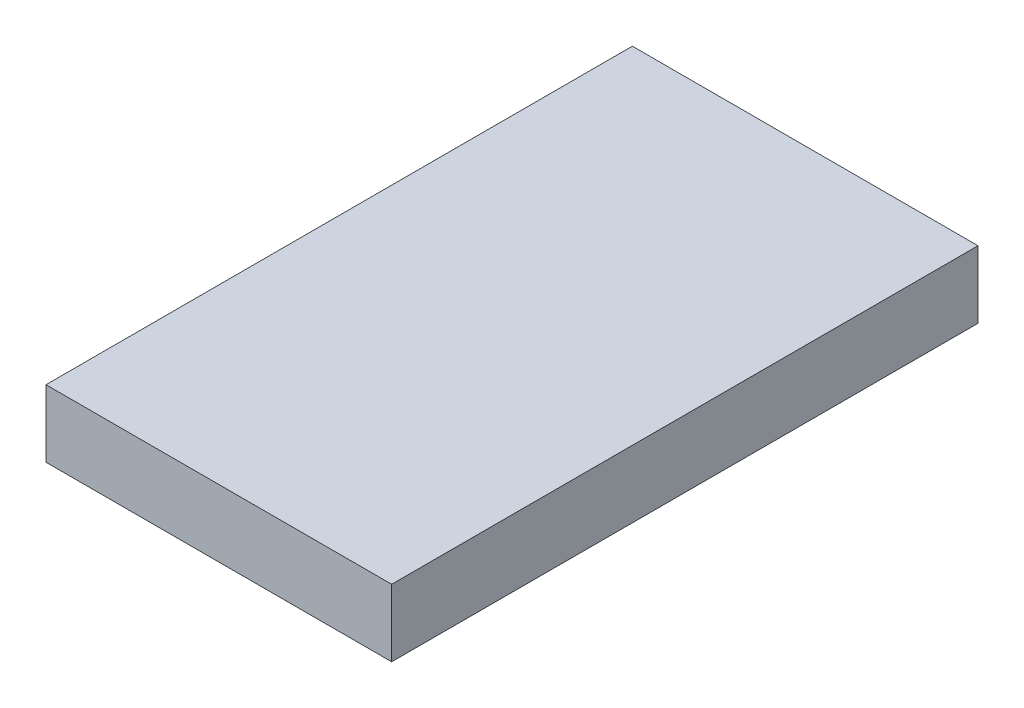
ISO-10303-21;
HEADER;
FILE_DESCRIPTION(('STEP AP214'),'2;1');
FILE_NAME('part.step','',(''),(''),'','','');
FILE_SCHEMA(('AUTOMOTIVE_DESIGN { 1 0 10303 214 1 1 1 1 }'));
ENDSEC;
DATA;
#1=APPLICATION_CONTEXT('core data for automotive mechanical design processes');
#2=APPLICATION_PROTOCOL_DEFINITION('international standard','automotive_design',2000,#1);
#3=PRODUCT_CONTEXT('',#1,'mechanical');
#4=PRODUCT('Part','Part','',(#3));
#5=PRODUCT_RELATED_PRODUCT_CATEGORY('part','',(#4));
#6=PRODUCT_DEFINITION_FORMATION('','',#4);
#7=PRODUCT_DEFINITION_CONTEXT('part definition',#1,'design');
#8=PRODUCT_DEFINITION('design','',#6,#7);
#9=PRODUCT_DEFINITION_SHAPE('','',#8);
#10=(LENGTH_UNIT() NAMED_UNIT(*) SI_UNIT(.MILLI.,.METRE.));
#11=(NAMED_UNIT(*) PLANE_ANGLE_UNIT() SI_UNIT($,.RADIAN.));
#12=(NAMED_UNIT(*) SI_UNIT($,.STERADIAN.) SOLID_ANGLE_UNIT());
#13=UNCERTAINTY_MEASURE_WITH_UNIT(LENGTH_MEASURE(1.E-05),#10,'distance_accuracy_value','');
#14=(GEOMETRIC_REPRESENTATION_CONTEXT(3) GLOBAL_UNCERTAINTY_ASSIGNED_CONTEXT((#13)) GLOBAL_UNIT_ASSIGNED_CONTEXT((#10,
#11,#12)) REPRESENTATION_CONTEXT('',''));
#15=CARTESIAN_POINT('',(0.,0.,0.));
#16=DIRECTION('',(0.,0.,1.));
#17=DIRECTION('',(1.,0.,0.));
#18=AXIS2_PLACEMENT_3D('',#15,#16,#17);
#19=CARTESIAN_POINT('',(0.,4.8,0.));
#20=DIRECTION('',(0.,0.,-1.));
#21=DIRECTION('',(-1.,0.,0.));
#22=AXIS2_PLACEMENT_3D('',#19,#20,#21);
#23=PLANE('',#22);
#24=DIRECTION('',(1.,0.,0.));
#25=VECTOR('',#24,1.);
#26=CARTESIAN_POINT('',(0.,0.,0.));
#27=LINE('',#26,#25);
#28=CARTESIAN_POINT('',(0.,0.,0.));
#29=VERTEX_POINT('',#28);
#30=CARTESIAN_POINT('',(24.7,0.,0.));
#31=VERTEX_POINT('',#30);
#32=EDGE_CURVE('E109',#29,#31,#27,.T.);
#33=ORIENTED_EDGE('',*,*,#32,.T.);
#34=DIRECTION('',(0.,-1.,0.));
#35=VECTOR('',#34,1.);
#36=CARTESIAN_POINT('',(24.7,4.8,0.));
#37=LINE('',#36,#35);
#38=CARTESIAN_POINT('',(24.7,4.8,0.));
#39=VERTEX_POINT('',#38);
#40=EDGE_CURVE('E11',#39,#31,#37,.T.);
#41=ORIENTED_EDGE('',*,*,#40,.F.);
#42=DIRECTION('',(1.,0.,0.));
#43=VECTOR('',#42,1.);
#44=CARTESIAN_POINT('',(0.,4.8,0.));
#45=LINE('',#44,#43);
#46=CARTESIAN_POINT('',(0.,4.8,0.));
#47=VERTEX_POINT('',#46);
#48=EDGE_CURVE('E91',#47,#39,#45,.T.);
#49=ORIENTED_EDGE('',*,*,#48,.F.);
#50=DIRECTION('',(0.,-1.,0.));
#51=VECTOR('',#50,1.);
#52=CARTESIAN_POINT('',(0.,4.8,0.));
#53=LINE('',#52,#51);
#54=EDGE_CURVE('E58',#47,#29,#53,.T.);
#55=ORIENTED_EDGE('',*,*,#54,.T.);
#56=EDGE_LOOP('',(#33,#41,#49,#55));
#57=FACE_BOUND('',#56,.T.);
#58=ADVANCED_FACE('F41',(#57),#23,.F.);
#59=CARTESIAN_POINT('',(24.7,4.8,0.));
#60=DIRECTION('',(-1.,0.,0.));
#61=DIRECTION('',(0.,0.,1.));
#62=AXIS2_PLACEMENT_3D('',#59,#60,#61);
#63=PLANE('',#62);
#64=DIRECTION('',(0.,0.,-1.));
#65=VECTOR('',#64,1.);
#66=CARTESIAN_POINT('',(24.7,0.,0.));
#67=LINE('',#66,#65);
#68=CARTESIAN_POINT('',(24.7,0.,-41.9));
#69=VERTEX_POINT('',#68);
#70=EDGE_CURVE('E97',#31,#69,#67,.T.);
#71=ORIENTED_EDGE('',*,*,#70,.T.);
#72=DIRECTION('',(0.,-1.,0.));
#73=VECTOR('',#72,1.);
#74=CARTESIAN_POINT('',(24.7,4.8,-41.9));
#75=LINE('',#74,#73);
#76=CARTESIAN_POINT('',(24.7,4.8,-41.9));
#77=VERTEX_POINT('',#76);
#78=EDGE_CURVE('E50',#77,#69,#75,.T.);
#79=ORIENTED_EDGE('',*,*,#78,.F.);
#80=DIRECTION('',(0.,0.,-1.));
#81=VECTOR('',#80,1.);
#82=CARTESIAN_POINT('',(24.7,4.8,0.));
#83=LINE('',#82,#81);
#84=EDGE_CURVE('E83',#39,#77,#83,.T.);
#85=ORIENTED_EDGE('',*,*,#84,.F.);
#86=ORIENTED_EDGE('',*,*,#40,.T.);
#87=EDGE_LOOP('',(#71,#79,#85,#86));
#88=FACE_BOUND('',#87,.T.);
#89=ADVANCED_FACE('F96',(#88),#63,.F.);
#90=CARTESIAN_POINT('',(0.,4.8,-41.9));
#91=DIRECTION('',(0.,0.,-1.));
#92=DIRECTION('',(-1.,0.,0.));
#93=AXIS2_PLACEMENT_3D('',#90,#91,#92);
#94=PLANE('',#93);
#95=DIRECTION('',(1.,0.,0.));
#96=VECTOR('',#95,1.);
#97=CARTESIAN_POINT('',(0.,0.,-41.9));
#98=LINE('',#97,#96);
#99=CARTESIAN_POINT('',(0.,0.,-41.9));
#100=VERTEX_POINT('',#99);
#101=EDGE_CURVE('E114',#100,#69,#98,.T.);
#102=ORIENTED_EDGE('',*,*,#101,.F.);
#103=DIRECTION('',(0.,-1.,0.));
#104=VECTOR('',#103,1.);
#105=CARTESIAN_POINT('',(0.,4.8,-41.9));
#106=LINE('',#105,#104);
#107=CARTESIAN_POINT('',(0.,4.8,-41.9));
#108=VERTEX_POINT('',#107);
#109=EDGE_CURVE('E72',#108,#100,#106,.T.);
#110=ORIENTED_EDGE('',*,*,#109,.F.);
#111=DIRECTION('',(1.,0.,0.));
#112=VECTOR('',#111,1.);
#113=CARTESIAN_POINT('',(0.,4.8,-41.9));
#114=LINE('',#113,#112);
#115=EDGE_CURVE('E90',#108,#77,#114,.T.);
#116=ORIENTED_EDGE('',*,*,#115,.T.);
#117=ORIENTED_EDGE('',*,*,#78,.T.);
#118=EDGE_LOOP('',(#102,#110,#116,#117));
#119=FACE_BOUND('',#118,.T.);
#120=ADVANCED_FACE('F101',(#119),#94,.T.);
#121=CARTESIAN_POINT('',(0.,4.8,0.));
#122=DIRECTION('',(-1.,0.,0.));
#123=DIRECTION('',(0.,0.,1.));
#124=AXIS2_PLACEMENT_3D('',#121,#122,#123);
#125=PLANE('',#124);
#126=DIRECTION('',(0.,0.,-1.));
#127=VECTOR('',#126,1.);
#128=CARTESIAN_POINT('',(0.,0.,0.));
#129=LINE('',#128,#127);
#130=EDGE_CURVE('E117',#29,#100,#129,.T.);
#131=ORIENTED_EDGE('',*,*,#130,.F.);
#132=ORIENTED_EDGE('',*,*,#54,.F.);
#133=DIRECTION('',(0.,0.,-1.));
#134=VECTOR('',#133,1.);
#135=CARTESIAN_POINT('',(0.,4.8,0.));
#136=LINE('',#135,#134);
#137=EDGE_CURVE('E103',#47,#108,#136,.T.);
#138=ORIENTED_EDGE('',*,*,#137,.T.);
#139=ORIENTED_EDGE('',*,*,#109,.T.);
#140=EDGE_LOOP('',(#131,#132,#138,#139));
#141=FACE_BOUND('',#140,.T.);
#142=ADVANCED_FACE('F127',(#141),#125,.T.);
#143=CARTESIAN_POINT('',(0.,4.8,0.));
#144=DIRECTION('',(0.,1.,0.));
#145=DIRECTION('',(0.,0.,1.));
#146=AXIS2_PLACEMENT_3D('',#143,#144,#145);
#147=PLANE('',#146);
#148=ORIENTED_EDGE('',*,*,#48,.T.);
#149=ORIENTED_EDGE('',*,*,#84,.T.);
#150=ORIENTED_EDGE('',*,*,#115,.F.);
#151=ORIENTED_EDGE('',*,*,#137,.F.);
#152=EDGE_LOOP('',(#148,#149,#150,#151));
#153=FACE_BOUND('',#152,.T.);
#154=ADVANCED_FACE('F87',(#153),#147,.T.);
#155=CARTESIAN_POINT('',(0.,0.,0.));
#156=DIRECTION('',(0.,1.,0.));
#157=DIRECTION('',(0.,0.,1.));
#158=AXIS2_PLACEMENT_3D('',#155,#156,#157);
#159=PLANE('',#158);
#160=ORIENTED_EDGE('',*,*,#32,.F.);
#161=ORIENTED_EDGE('',*,*,#130,.T.);
#162=ORIENTED_EDGE('',*,*,#101,.T.);
#163=ORIENTED_EDGE('',*,*,#70,.F.);
#164=EDGE_LOOP('',(#160,#161,#162,#163));
#165=FACE_BOUND('',#164,.T.);
#166=ADVANCED_FACE('F126',(#165),#159,.F.);
#167=CLOSED_SHELL('',(#58,#89,#120,#142,#154,#166));
#168=MANIFOLD_SOLID_BREP('B2',#167);
#169=ADVANCED_BREP_SHAPE_REPRESENTATION('',(#18,#168),#14);
#170=SHAPE_DEFINITION_REPRESENTATION(#9,#169);
ENDSEC;
END-ISO-10303-21;
